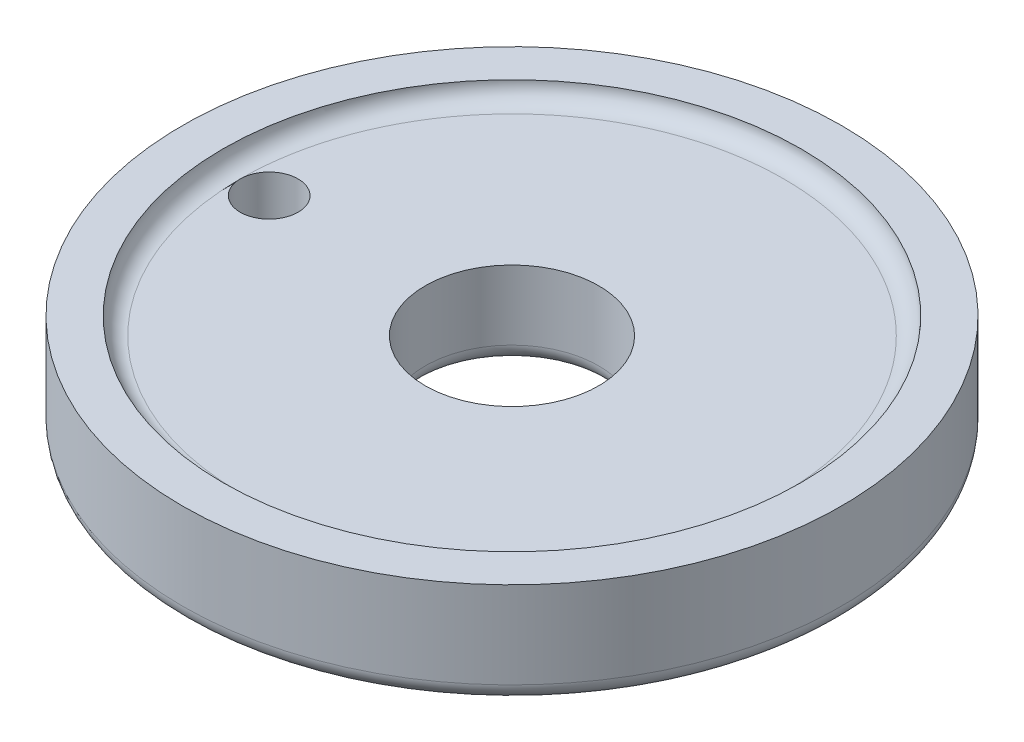
ISO-10303-21;
HEADER;
FILE_DESCRIPTION(('STEP AP214'),'2;1');
FILE_NAME('part.step','',(''),(''),'','','');
FILE_SCHEMA(('AUTOMOTIVE_DESIGN { 1 0 10303 214 1 1 1 1 }'));
ENDSEC;
DATA;
#1=APPLICATION_CONTEXT('core data for automotive mechanical design processes');
#2=APPLICATION_PROTOCOL_DEFINITION('international standard','automotive_design',2000,#1);
#3=PRODUCT_CONTEXT('',#1,'mechanical');
#4=PRODUCT('Part','Part','',(#3));
#5=PRODUCT_RELATED_PRODUCT_CATEGORY('part','',(#4));
#6=PRODUCT_DEFINITION_FORMATION('','',#4);
#7=PRODUCT_DEFINITION_CONTEXT('part definition',#1,'design');
#8=PRODUCT_DEFINITION('design','',#6,#7);
#9=PRODUCT_DEFINITION_SHAPE('','',#8);
#10=(LENGTH_UNIT() NAMED_UNIT(*) SI_UNIT(.MILLI.,.METRE.));
#11=(NAMED_UNIT(*) PLANE_ANGLE_UNIT() SI_UNIT($,.RADIAN.));
#12=(NAMED_UNIT(*) SI_UNIT($,.STERADIAN.) SOLID_ANGLE_UNIT());
#13=UNCERTAINTY_MEASURE_WITH_UNIT(LENGTH_MEASURE(1.E-05),#10,'distance_accuracy_value','');
#14=(GEOMETRIC_REPRESENTATION_CONTEXT(3) GLOBAL_UNCERTAINTY_ASSIGNED_CONTEXT((#13)) GLOBAL_UNIT_ASSIGNED_CONTEXT((#10,
#11,#12)) REPRESENTATION_CONTEXT('',''));
#15=CARTESIAN_POINT('',(0.,0.,0.));
#16=DIRECTION('',(0.,0.,1.));
#17=DIRECTION('',(1.,0.,0.));
#18=AXIS2_PLACEMENT_3D('',#15,#16,#17);
#19=CARTESIAN_POINT('',(0.,-18.,0.));
#20=DIRECTION('',(0.,1.,0.));
#21=DIRECTION('',(0.,0.,1.));
#22=AXIS2_PLACEMENT_3D('',#19,#20,#21);
#23=CYLINDRICAL_SURFACE('',#22,15.);
#24=CARTESIAN_POINT('',(0.,-15.,0.));
#25=DIRECTION('',(0.,1.,0.));
#26=DIRECTION('',(0.,0.,1.));
#27=AXIS2_PLACEMENT_3D('',#24,#25,#26);
#28=CIRCLE('',#27,15.);
#29=CARTESIAN_POINT('',(0.,-15.,15.));
#30=VERTEX_POINT('',#29);
#31=EDGE_CURVE('E55',#30,#30,#28,.F.);
#32=ORIENTED_EDGE('',*,*,#31,.T.);
#33=EDGE_LOOP('',(#32));
#34=FACE_BOUND('',#33,.T.);
#35=CARTESIAN_POINT('',(0.,-3.,0.));
#36=DIRECTION('',(0.,1.,0.));
#37=DIRECTION('',(0.,0.,1.));
#38=AXIS2_PLACEMENT_3D('',#35,#36,#37);
#39=CIRCLE('',#38,15.);
#40=CARTESIAN_POINT('',(0.,-3.,15.));
#41=VERTEX_POINT('',#40);
#42=EDGE_CURVE('E73',#41,#41,#39,.T.);
#43=ORIENTED_EDGE('',*,*,#42,.T.);
#44=EDGE_LOOP('',(#43));
#45=FACE_BOUND('',#44,.T.);
#46=ADVANCED_FACE('F47',(#34,#45),#23,.F.);
#47=CARTESIAN_POINT('',(-42.,-18.,0.));
#48=DIRECTION('',(0.,1.,0.));
#49=DIRECTION('',(0.,0.,1.));
#50=AXIS2_PLACEMENT_3D('',#47,#48,#49);
#51=CYLINDRICAL_SURFACE('',#50,5.);
#52=CARTESIAN_POINT('',(-42.,-18.,0.));
#53=DIRECTION('',(0.,1.,0.));
#54=DIRECTION('',(0.,0.,1.));
#55=AXIS2_PLACEMENT_3D('',#52,#53,#54);
#56=CIRCLE('',#55,5.);
#57=CARTESIAN_POINT('',(-42.,-18.,5.));
#58=VERTEX_POINT('',#57);
#59=EDGE_CURVE('E65',#58,#58,#56,.T.);
#60=ORIENTED_EDGE('',*,*,#59,.F.);
#61=EDGE_LOOP('',(#60));
#62=FACE_BOUND('',#61,.T.);
#63=CARTESIAN_POINT('',(-42.,-3.,0.));
#64=DIRECTION('',(0.,1.,0.));
#65=DIRECTION('',(0.,0.,1.));
#66=AXIS2_PLACEMENT_3D('',#63,#64,#65);
#67=CIRCLE('',#66,5.);
#68=CARTESIAN_POINT('',(-47.,-3.,0.));
#69=VERTEX_POINT('',#68);
#70=EDGE_CURVE('E62',#69,#69,#67,.F.);
#71=ORIENTED_EDGE('',*,*,#70,.F.);
#72=EDGE_LOOP('',(#71));
#73=FACE_BOUND('',#72,.T.);
#74=ADVANCED_FACE('F111',(#62,#73),#51,.F.);
#75=CARTESIAN_POINT('',(0.,-18.,0.));
#76=DIRECTION('',(0.,1.,0.));
#77=DIRECTION('',(0.,0.,1.));
#78=AXIS2_PLACEMENT_3D('',#75,#76,#77);
#79=CYLINDRICAL_SURFACE('',#78,57.);
#80=CARTESIAN_POINT('',(0.,-15.,0.));
#81=DIRECTION('',(0.,1.,0.));
#82=DIRECTION('',(0.,0.,1.));
#83=AXIS2_PLACEMENT_3D('',#80,#81,#82);
#84=CIRCLE('',#83,57.);
#85=CARTESIAN_POINT('',(0.,-15.,57.));
#86=VERTEX_POINT('',#85);
#87=EDGE_CURVE('E87',#86,#86,#84,.T.);
#88=ORIENTED_EDGE('',*,*,#87,.T.);
#89=EDGE_LOOP('',(#88));
#90=FACE_BOUND('',#89,.T.);
#91=CARTESIAN_POINT('',(0.,0.,0.));
#92=DIRECTION('',(0.,1.,0.));
#93=DIRECTION('',(0.,0.,1.));
#94=AXIS2_PLACEMENT_3D('',#91,#92,#93);
#95=CIRCLE('',#94,57.);
#96=CARTESIAN_POINT('',(0.,0.,57.));
#97=VERTEX_POINT('',#96);
#98=EDGE_CURVE('E70',#97,#97,#95,.T.);
#99=ORIENTED_EDGE('',*,*,#98,.F.);
#100=EDGE_LOOP('',(#99));
#101=FACE_BOUND('',#100,.T.);
#102=ADVANCED_FACE('F117',(#90,#101),#79,.T.);
#103=CARTESIAN_POINT('',(0.,-18.,0.));
#104=DIRECTION('',(0.,1.,0.));
#105=DIRECTION('',(0.,0.,1.));
#106=AXIS2_PLACEMENT_3D('',#103,#104,#105);
#107=PLANE('',#106);
#108=CARTESIAN_POINT('',(0.,-18.,0.));
#109=DIRECTION('',(0.,1.,0.));
#110=DIRECTION('',(0.,0.,1.));
#111=AXIS2_PLACEMENT_3D('',#108,#109,#110);
#112=CIRCLE('',#111,54.);
#113=CARTESIAN_POINT('',(0.,-18.,54.));
#114=VERTEX_POINT('',#113);
#115=EDGE_CURVE('E79',#114,#114,#112,.F.);
#116=ORIENTED_EDGE('',*,*,#115,.T.);
#117=EDGE_LOOP('',(#116));
#118=FACE_BOUND('',#117,.T.);
#119=CARTESIAN_POINT('',(0.,-18.,0.));
#120=DIRECTION('',(0.,1.,0.));
#121=DIRECTION('',(0.,0.,1.));
#122=AXIS2_PLACEMENT_3D('',#119,#120,#121);
#123=CIRCLE('',#122,18.);
#124=CARTESIAN_POINT('',(0.,-18.,18.));
#125=VERTEX_POINT('',#124);
#126=EDGE_CURVE('E83',#125,#125,#123,.T.);
#127=ORIENTED_EDGE('',*,*,#126,.T.);
#128=EDGE_LOOP('',(#127));
#129=FACE_BOUND('',#128,.T.);
#130=ORIENTED_EDGE('',*,*,#59,.T.);
#131=EDGE_LOOP('',(#130));
#132=FACE_BOUND('',#131,.T.);
#133=ADVANCED_FACE('F120',(#118,#129,#132),#107,.F.);
#134=CARTESIAN_POINT('',(0.,0.,0.));
#135=DIRECTION('',(0.,1.,0.));
#136=DIRECTION('',(0.,0.,1.));
#137=AXIS2_PLACEMENT_3D('',#134,#135,#136);
#138=PLANE('',#137);
#139=CARTESIAN_POINT('',(0.,0.,0.));
#140=DIRECTION('',(0.,1.,0.));
#141=DIRECTION('',(0.,0.,1.));
#142=AXIS2_PLACEMENT_3D('',#139,#140,#141);
#143=CIRCLE('',#142,50.);
#144=CARTESIAN_POINT('',(0.,0.,50.));
#145=VERTEX_POINT('',#144);
#146=EDGE_CURVE('E66',#145,#145,#143,.T.);
#147=ORIENTED_EDGE('',*,*,#146,.F.);
#148=EDGE_LOOP('',(#147));
#149=FACE_BOUND('',#148,.T.);
#150=ORIENTED_EDGE('',*,*,#98,.T.);
#151=EDGE_LOOP('',(#150));
#152=FACE_BOUND('',#151,.T.);
#153=ADVANCED_FACE('F123',(#149,#152),#138,.T.);
#154=CARTESIAN_POINT('',(0.,-15.,0.));
#155=DIRECTION('',(0.,1.,0.));
#156=DIRECTION('',(0.,0.,1.));
#157=AXIS2_PLACEMENT_3D('',#154,#155,#156);
#158=TOROIDAL_SURFACE('',#157,54.,3.);
#159=ORIENTED_EDGE('',*,*,#115,.F.);
#160=EDGE_LOOP('',(#159));
#161=FACE_BOUND('',#160,.T.);
#162=ORIENTED_EDGE('',*,*,#87,.F.);
#163=EDGE_LOOP('',(#162));
#164=FACE_BOUND('',#163,.T.);
#165=ADVANCED_FACE('F107',(#161,#164),#158,.T.);
#166=CARTESIAN_POINT('',(0.,-15.,0.));
#167=DIRECTION('',(0.,1.,0.));
#168=DIRECTION('',(0.,0.,1.));
#169=AXIS2_PLACEMENT_3D('',#166,#167,#168);
#170=TOROIDAL_SURFACE('',#169,18.,3.);
#171=ORIENTED_EDGE('',*,*,#31,.F.);
#172=EDGE_LOOP('',(#171));
#173=FACE_BOUND('',#172,.T.);
#174=ORIENTED_EDGE('',*,*,#126,.F.);
#175=EDGE_LOOP('',(#174));
#176=FACE_BOUND('',#175,.T.);
#177=ADVANCED_FACE('F100',(#173,#176),#170,.T.);
#178=CARTESIAN_POINT('',(0.,-3.,0.));
#179=DIRECTION('',(0.,1.,0.));
#180=DIRECTION('',(0.,0.,1.));
#181=AXIS2_PLACEMENT_3D('',#178,#179,#180);
#182=PLANE('',#181);
#183=ORIENTED_EDGE('',*,*,#42,.F.);
#184=EDGE_LOOP('',(#183));
#185=FACE_BOUND('',#184,.T.);
#186=ORIENTED_EDGE('',*,*,#70,.T.);
#187=CARTESIAN_POINT('',(0.,-3.,0.));
#188=DIRECTION('',(0.,1.,0.));
#189=DIRECTION('',(0.,0.,1.));
#190=AXIS2_PLACEMENT_3D('',#187,#188,#189);
#191=CIRCLE('',#190,47.);
#192=EDGE_CURVE('E11',#69,#69,#191,.T.);
#193=ORIENTED_EDGE('',*,*,#192,.T.);
#194=EDGE_LOOP('',(#186,#193));
#195=FACE_BOUND('',#194,.T.);
#196=ADVANCED_FACE('F60',(#185,#195),#182,.T.);
#197=CARTESIAN_POINT('',(0.,0.,0.));
#198=DIRECTION('',(0.,1.,0.));
#199=DIRECTION('',(0.,0.,1.));
#200=AXIS2_PLACEMENT_3D('',#197,#198,#199);
#201=TOROIDAL_SURFACE('',#200,47.,3.);
#202=ORIENTED_EDGE('',*,*,#146,.T.);
#203=EDGE_LOOP('',(#202));
#204=FACE_BOUND('',#203,.T.);
#205=ORIENTED_EDGE('',*,*,#192,.F.);
#206=EDGE_LOOP('',(#205));
#207=FACE_BOUND('',#206,.T.);
#208=ADVANCED_FACE('F49',(#204,#207),#201,.F.);
#209=CLOSED_SHELL('',(#46,#74,#102,#133,#153,#165,#177,#196,#208));
#210=MANIFOLD_SOLID_BREP('B2',#209);
#211=ADVANCED_BREP_SHAPE_REPRESENTATION('',(#18,#210),#14);
#212=SHAPE_DEFINITION_REPRESENTATION(#9,#211);
ENDSEC;
END-ISO-10303-21;
